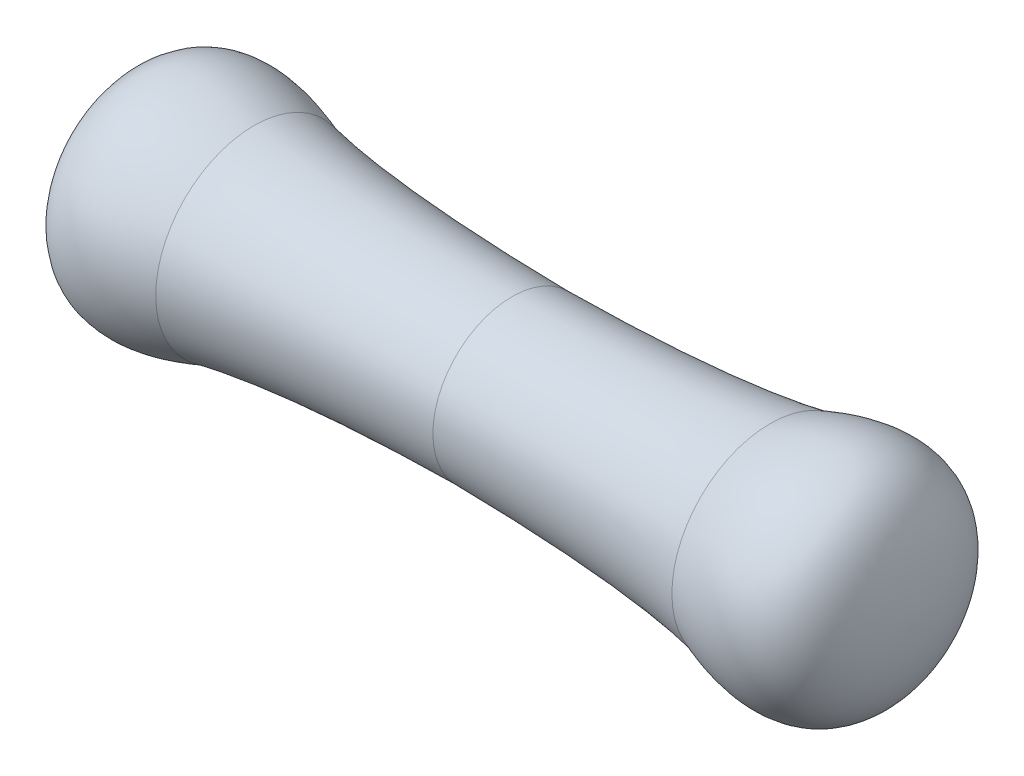
ISO-10303-21;
HEADER;
FILE_DESCRIPTION(('STEP AP214'),'2;1');
FILE_NAME('part.step','',(''),(''),'','','');
FILE_SCHEMA(('AUTOMOTIVE_DESIGN { 1 0 10303 214 1 1 1 1 }'));
ENDSEC;
DATA;
#1=APPLICATION_CONTEXT('core data for automotive mechanical design processes');
#2=APPLICATION_PROTOCOL_DEFINITION('international standard','automotive_design',2000,#1);
#3=PRODUCT_CONTEXT('',#1,'mechanical');
#4=PRODUCT('Part','Part','',(#3));
#5=PRODUCT_RELATED_PRODUCT_CATEGORY('part','',(#4));
#6=PRODUCT_DEFINITION_FORMATION('','',#4);
#7=PRODUCT_DEFINITION_CONTEXT('part definition',#1,'design');
#8=PRODUCT_DEFINITION('design','',#6,#7);
#9=PRODUCT_DEFINITION_SHAPE('','',#8);
#10=(LENGTH_UNIT() NAMED_UNIT(*) SI_UNIT(.MILLI.,.METRE.));
#11=(NAMED_UNIT(*) PLANE_ANGLE_UNIT() SI_UNIT($,.RADIAN.));
#12=(NAMED_UNIT(*) SI_UNIT($,.STERADIAN.) SOLID_ANGLE_UNIT());
#13=UNCERTAINTY_MEASURE_WITH_UNIT(LENGTH_MEASURE(1.E-05),#10,'distance_accuracy_value','');
#14=(GEOMETRIC_REPRESENTATION_CONTEXT(3) GLOBAL_UNCERTAINTY_ASSIGNED_CONTEXT((#13)) GLOBAL_UNIT_ASSIGNED_CONTEXT((#10,
#11,#12)) REPRESENTATION_CONTEXT('',''));
#15=CARTESIAN_POINT('',(0.,0.,0.));
#16=DIRECTION('',(0.,0.,1.));
#17=DIRECTION('',(1.,0.,0.));
#18=AXIS2_PLACEMENT_3D('',#15,#16,#17);
#19=CARTESIAN_POINT('',(3.5,0.,0.));
#20=CARTESIAN_POINT('',(3.46748070948507,1.3174781914769,0.));
#21=CARTESIAN_POINT('',(2.2457902294798,0.854418090184577,0.));
#22=B_SPLINE_CURVE_WITH_KNOTS('',2,(#19,#20,#21),.UNSPECIFIED.,.F.,.F.,(3,3),(0.,1.),.UNSPECIFIED.);
#23=CARTESIAN_POINT('',(-3.5,0.,0.));
#24=DIRECTION('',(-1.,0.,0.));
#25=AXIS1_PLACEMENT('',#23,#24);
#26=SURFACE_OF_REVOLUTION('',#22,#25);
#27=CARTESIAN_POINT('',(2.2457902294798,0.,0.));
#28=DIRECTION('',(-1.,0.,0.));
#29=DIRECTION('',(0.,0.,1.));
#30=AXIS2_PLACEMENT_3D('',#27,#28,#29);
#31=CIRCLE('',#30,0.854418090184577);
#32=CARTESIAN_POINT('',(2.2457902294798,0.,0.854418090184577));
#33=VERTEX_POINT('',#32);
#34=EDGE_CURVE('E59',#33,#33,#31,.T.);
#35=ORIENTED_EDGE('',*,*,#34,.F.);
#36=EDGE_LOOP('',(#35));
#37=FACE_BOUND('',#36,.T.);
#38=CARTESIAN_POINT('',(3.5,0.,0.));
#39=VERTEX_POINT('',#38);
#40=VERTEX_LOOP('',#39);
#41=FACE_BOUND('',#40,.T.);
#42=ADVANCED_FACE('F32',(#37,#41),#26,.T.);
#43=CARTESIAN_POINT('',(-2.2457902294798,0.854418090184577,0.));
#44=CARTESIAN_POINT('',(-3.46748070948507,1.3174781914769,0.));
#45=CARTESIAN_POINT('',(-3.5,0.,0.));
#46=B_SPLINE_CURVE_WITH_KNOTS('',2,(#43,#44,#45),.UNSPECIFIED.,.F.,.F.,(3,3),(0.,1.),.UNSPECIFIED.);
#47=CARTESIAN_POINT('',(-3.5,0.,0.));
#48=DIRECTION('',(-1.,0.,0.));
#49=AXIS1_PLACEMENT('',#47,#48);
#50=SURFACE_OF_REVOLUTION('',#46,#49);
#51=CARTESIAN_POINT('',(-3.5,0.,0.));
#52=VERTEX_POINT('',#51);
#53=VERTEX_LOOP('',#52);
#54=FACE_BOUND('',#53,.T.);
#55=CARTESIAN_POINT('',(-2.2457902294798,0.,0.));
#56=DIRECTION('',(-1.,0.,0.));
#57=DIRECTION('',(0.,0.,1.));
#58=AXIS2_PLACEMENT_3D('',#55,#56,#57);
#59=CIRCLE('',#58,0.854418090184577);
#60=CARTESIAN_POINT('',(-2.2457902294798,0.,0.854418090184577));
#61=VERTEX_POINT('',#60);
#62=EDGE_CURVE('E11',#61,#61,#59,.T.);
#63=ORIENTED_EDGE('',*,*,#62,.T.);
#64=EDGE_LOOP('',(#63));
#65=FACE_BOUND('',#64,.T.);
#66=ADVANCED_FACE('F46',(#54,#65),#50,.T.);
#67=CARTESIAN_POINT('',(0.,0.688368717849187,0.));
#68=CARTESIAN_POINT('',(-1.50727115109751,0.704582097158764,0.));
#69=CARTESIAN_POINT('',(-2.2457902294798,0.854418090184577,0.));
#70=B_SPLINE_CURVE_WITH_KNOTS('',2,(#67,#68,#69),.UNSPECIFIED.,.F.,.F.,(3,3),(0.,1.),.UNSPECIFIED.);
#71=CARTESIAN_POINT('',(-3.5,0.,0.));
#72=DIRECTION('',(-1.,0.,0.));
#73=AXIS1_PLACEMENT('',#71,#72);
#74=SURFACE_OF_REVOLUTION('',#70,#73);
#75=ORIENTED_EDGE('',*,*,#62,.F.);
#76=EDGE_LOOP('',(#75));
#77=FACE_BOUND('',#76,.T.);
#78=CARTESIAN_POINT('',(0.,0.,0.));
#79=DIRECTION('',(-1.,0.,0.));
#80=DIRECTION('',(0.,0.,1.));
#81=AXIS2_PLACEMENT_3D('',#78,#79,#80);
#82=CIRCLE('',#81,0.688368717849187);
#83=CARTESIAN_POINT('',(0.,0.,0.688368717849187));
#84=VERTEX_POINT('',#83);
#85=EDGE_CURVE('E40',#84,#84,#82,.T.);
#86=ORIENTED_EDGE('',*,*,#85,.T.);
#87=EDGE_LOOP('',(#86));
#88=FACE_BOUND('',#87,.T.);
#89=ADVANCED_FACE('F49',(#77,#88),#74,.T.);
#90=CARTESIAN_POINT('',(2.2457902294798,0.854418090184577,0.));
#91=CARTESIAN_POINT('',(1.50727115109751,0.704582097158764,0.));
#92=CARTESIAN_POINT('',(0.,0.688368717849187,0.));
#93=B_SPLINE_CURVE_WITH_KNOTS('',2,(#90,#91,#92),.UNSPECIFIED.,.F.,.F.,(3,3),(0.,1.),.UNSPECIFIED.);
#94=CARTESIAN_POINT('',(-3.5,0.,0.));
#95=DIRECTION('',(-1.,0.,0.));
#96=AXIS1_PLACEMENT('',#94,#95);
#97=SURFACE_OF_REVOLUTION('',#93,#96);
#98=ORIENTED_EDGE('',*,*,#85,.F.);
#99=EDGE_LOOP('',(#98));
#100=FACE_BOUND('',#99,.T.);
#101=ORIENTED_EDGE('',*,*,#34,.T.);
#102=EDGE_LOOP('',(#101));
#103=FACE_BOUND('',#102,.T.);
#104=ADVANCED_FACE('F54',(#100,#103),#97,.T.);
#105=CLOSED_SHELL('',(#42,#66,#89,#104));
#106=MANIFOLD_SOLID_BREP('B2',#105);
#107=ADVANCED_BREP_SHAPE_REPRESENTATION('',(#18,#106),#14);
#108=SHAPE_DEFINITION_REPRESENTATION(#9,#107);
ENDSEC;
END-ISO-10303-21;
